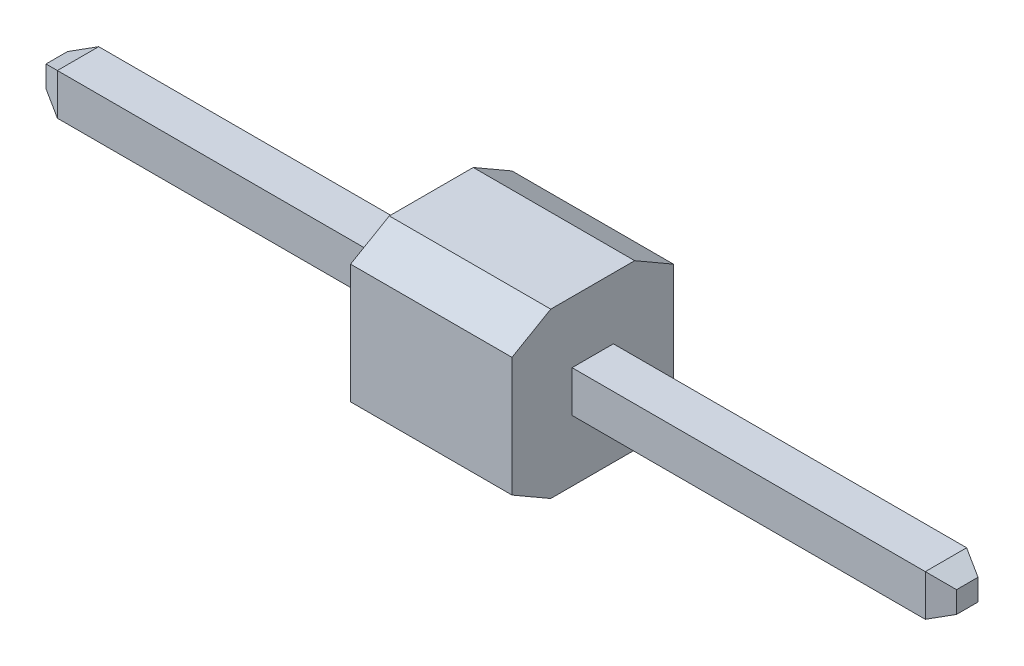
ISO-10303-21;
HEADER;
FILE_DESCRIPTION(('STEP AP214'),'2;1');
FILE_NAME('part.step','',(''),(''),'','','');
FILE_SCHEMA(('AUTOMOTIVE_DESIGN { 1 0 10303 214 1 1 1 1 }'));
ENDSEC;
DATA;
#1=APPLICATION_CONTEXT('core data for automotive mechanical design processes');
#2=APPLICATION_PROTOCOL_DEFINITION('international standard','automotive_design',2000,#1);
#3=PRODUCT_CONTEXT('',#1,'mechanical');
#4=PRODUCT('Part','Part','',(#3));
#5=PRODUCT_RELATED_PRODUCT_CATEGORY('part','',(#4));
#6=PRODUCT_DEFINITION_FORMATION('','',#4);
#7=PRODUCT_DEFINITION_CONTEXT('part definition',#1,'design');
#8=PRODUCT_DEFINITION('design','',#6,#7);
#9=PRODUCT_DEFINITION_SHAPE('','',#8);
#10=(LENGTH_UNIT() NAMED_UNIT(*) SI_UNIT(.MILLI.,.METRE.));
#11=(NAMED_UNIT(*) PLANE_ANGLE_UNIT() SI_UNIT($,.RADIAN.));
#12=(NAMED_UNIT(*) SI_UNIT($,.STERADIAN.) SOLID_ANGLE_UNIT());
#13=UNCERTAINTY_MEASURE_WITH_UNIT(LENGTH_MEASURE(1.E-05),#10,'distance_accuracy_value','');
#14=(GEOMETRIC_REPRESENTATION_CONTEXT(3) GLOBAL_UNCERTAINTY_ASSIGNED_CONTEXT((#13)) GLOBAL_UNIT_ASSIGNED_CONTEXT((#10,
#11,#12)) REPRESENTATION_CONTEXT('',''));
#15=CARTESIAN_POINT('',(0.,0.,0.));
#16=DIRECTION('',(0.,0.,1.));
#17=DIRECTION('',(1.,0.,0.));
#18=AXIS2_PLACEMENT_3D('',#15,#16,#17);
#19=CARTESIAN_POINT('',(5.42105161362358,7.93712144810304,-2.62999892057032));
#20=DIRECTION('',(1.,-9.93476518829084E-08,4.37113882867379E-08));
#21=DIRECTION('',(-9.93476589883358E-08,-1.,8.74227765734759E-08));
#22=AXIS2_PLACEMENT_3D('',#19,#20,#21);
#23=PLANE('',#22);
#24=DIRECTION('',(-1.18186632779335E-08,-0.50000007571054,-0.866025360072934));
#25=VECTOR('',#24,1.);
#26=CARTESIAN_POINT('',(5.42105142144897,6.69353174686681,-1.05999881185224));
#27=LINE('',#26,#25);
#28=CARTESIAN_POINT('',(5.42105142144897,6.69353174686681,-1.05999881185224));
#29=VERTEX_POINT('',#28);
#30=CARTESIAN_POINT('',(5.42105141326076,6.34712153290314,-1.6599987815681));
#31=VERTEX_POINT('',#30);
#32=EDGE_CURVE('E11',#29,#31,#27,.T.);
#33=ORIENTED_EDGE('',*,*,#32,.T.);
#34=DIRECTION('',(4.37113811813104E-08,-8.74227842254741E-08,-0.999999999999995));
#35=VECTOR('',#34,1.);
#36=CARTESIAN_POINT('',(5.42105141326076,6.34712153290314,-1.6599987815681));
#37=LINE('',#36,#35);
#38=CARTESIAN_POINT('',(5.42105147008556,6.34712141925352,-2.9599987815681));
#39=VERTEX_POINT('',#38);
#40=EDGE_CURVE('E304',#31,#39,#37,.T.);
#41=ORIENTED_EDGE('',*,*,#40,.T.);
#42=DIRECTION('',(8.75289963531793E-08,0.499999924289839,-0.866025447495712));
#43=VECTOR('',#42,1.);
#44=CARTESIAN_POINT('',(5.42105147008556,6.34712141925352,-2.9599987815681));
#45=LINE('',#44,#43);
#46=CARTESIAN_POINT('',(5.42105153072743,6.69353152830985,-3.55999881185224));
#47=VERTEX_POINT('',#46);
#48=EDGE_CURVE('E296',#39,#47,#45,.T.);
#49=ORIENTED_EDGE('',*,*,#48,.T.);
#50=DIRECTION('',(9.93476588436476E-08,0.999999999999991,-8.74227764822786E-08));
#51=VECTOR('',#50,1.);
#52=CARTESIAN_POINT('',(5.42105153072743,6.69353152830985,-3.55999881185224));
#53=LINE('',#52,#51);
#54=CARTESIAN_POINT('',(5.4210517142404,8.54071120527985,-3.55999897333782));
#55=VERTEX_POINT('',#54);
#56=EDGE_CURVE('E281',#47,#55,#53,.T.);
#57=ORIENTED_EDGE('',*,*,#56,.T.);
#58=DIRECTION('',(-1.18186632778483E-08,-0.500000075710534,-0.866025360072937));
#59=VECTOR('',#58,1.);
#60=CARTESIAN_POINT('',(5.42105172242861,8.88712141925352,-2.95999900362196));
#61=LINE('',#60,#59);
#62=CARTESIAN_POINT('',(5.42105172242861,8.88712141925352,-2.95999900362196));
#63=VERTEX_POINT('',#62);
#64=EDGE_CURVE('E265',#63,#55,#61,.T.);
#65=ORIENTED_EDGE('',*,*,#64,.F.);
#66=DIRECTION('',(4.37113811813104E-08,-8.74227842254741E-08,-0.999999999999995));
#67=VECTOR('',#66,1.);
#68=CARTESIAN_POINT('',(5.42105166560382,8.88712153290314,-1.65999900362196));
#69=LINE('',#68,#67);
#70=CARTESIAN_POINT('',(5.42105166560382,8.88712153290314,-1.65999900362196));
#71=VERTEX_POINT('',#70);
#72=EDGE_CURVE('E248',#71,#63,#69,.T.);
#73=ORIENTED_EDGE('',*,*,#72,.F.);
#74=DIRECTION('',(8.75289963525481E-08,0.499999924289833,-0.866025447495715));
#75=VECTOR('',#74,1.);
#76=CARTESIAN_POINT('',(5.42105160496195,8.54071142383681,-1.05999897333782));
#77=LINE('',#76,#75);
#78=CARTESIAN_POINT('',(5.42105160496195,8.54071142383681,-1.05999897333782));
#79=VERTEX_POINT('',#78);
#80=EDGE_CURVE('E242',#79,#71,#77,.T.);
#81=ORIENTED_EDGE('',*,*,#80,.F.);
#82=DIRECTION('',(9.93476588436476E-08,0.999999999999991,-8.74227762418639E-08));
#83=VECTOR('',#82,1.);
#84=CARTESIAN_POINT('',(5.42105142144897,6.69353174686681,-1.05999881185224));
#85=LINE('',#84,#83);
#86=EDGE_CURVE('E236',#29,#79,#85,.T.);
#87=ORIENTED_EDGE('',*,*,#86,.F.);
#88=EDGE_LOOP('',(#33,#41,#49,#57,#65,#73,#81,#87));
#89=FACE_BOUND('',#88,.T.);
#90=DIRECTION('',(-4.37113817364219E-08,8.74227856773042E-08,0.999999999999995));
#91=VECTOR('',#90,1.);
#92=CARTESIAN_POINT('',(5.42105155004108,7.29712144810304,-2.62999886461974));
#93=LINE('',#92,#91);
#94=CARTESIAN_POINT('',(5.42105155004108,7.29712144810304,-2.62999886461974));
#95=VERTEX_POINT('',#94);
#96=CARTESIAN_POINT('',(5.4210515220658,7.29712150405362,-1.98999886461974));
#97=VERTEX_POINT('',#96);
#98=EDGE_CURVE('E302',#95,#97,#93,.T.);
#99=ORIENTED_EDGE('',*,*,#98,.T.);
#100=DIRECTION('',(-9.93476592658906E-08,-0.999999999999991,8.74227766567418E-08));
#101=VECTOR('',#100,1.);
#102=CARTESIAN_POINT('',(5.4210515856483,7.93712150405362,-1.98999892057032));
#103=LINE('',#102,#101);
#104=CARTESIAN_POINT('',(5.4210515856483,7.93712150405362,-1.98999892057032));
#105=VERTEX_POINT('',#104);
#106=EDGE_CURVE('E293',#105,#97,#103,.T.);
#107=ORIENTED_EDGE('',*,*,#106,.F.);
#108=DIRECTION('',(-4.37113803486431E-08,8.74227856773043E-08,0.999999999999995));
#109=VECTOR('',#108,1.);
#110=CARTESIAN_POINT('',(5.42105161362358,7.93712144810304,-2.62999892057032));
#111=LINE('',#110,#109);
#112=CARTESIAN_POINT('',(5.42105161362358,7.93712144810304,-2.62999892057032));
#113=VERTEX_POINT('',#112);
#114=EDGE_CURVE('E278',#113,#105,#111,.T.);
#115=ORIENTED_EDGE('',*,*,#114,.F.);
#116=DIRECTION('',(-9.93476578781118E-08,-0.999999999999991,8.74227759628524E-08));
#117=VECTOR('',#116,1.);
#118=CARTESIAN_POINT('',(5.42105161362358,7.93712144810304,-2.62999892057032));
#119=LINE('',#118,#117);
#120=EDGE_CURVE('E263',#113,#95,#119,.T.);
#121=ORIENTED_EDGE('',*,*,#120,.T.);
#122=EDGE_LOOP('',(#99,#107,#115,#121));
#123=FACE_BOUND('',#122,.T.);
#124=ADVANCED_FACE('F17',(#89,#123),#23,.T.);
#125=CARTESIAN_POINT('',(2.92105161362358,7.93712169647217,-2.62999902984879));
#126=DIRECTION('',(1.,-9.93476518829084E-08,4.37113882867379E-08));
#127=DIRECTION('',(-9.93476589883358E-08,-1.,8.74227765734759E-08));
#128=AXIS2_PLACEMENT_3D('',#125,#126,#127);
#129=PLANE('',#128);
#130=DIRECTION('',(-1.1818662636946E-08,-0.50000007571054,-0.866025360072934));
#131=VECTOR('',#130,1.);
#132=CARTESIAN_POINT('',(2.92105142144897,6.69353199523594,-1.05999892113071));
#133=LINE('',#132,#131);
#134=CARTESIAN_POINT('',(2.92105142144897,6.69353199523594,-1.05999892113071));
#135=VERTEX_POINT('',#134);
#136=CARTESIAN_POINT('',(2.92105141326076,6.34712178127227,-1.65999889084657));
#137=VERTEX_POINT('',#136);
#138=EDGE_CURVE('E24',#135,#137,#133,.T.);
#139=ORIENTED_EDGE('',*,*,#138,.F.);
#140=DIRECTION('',(9.93476590840623E-08,0.999999999999991,-8.74227762418639E-08));
#141=VECTOR('',#140,1.);
#142=CARTESIAN_POINT('',(2.92105142144897,6.69353199523594,-1.05999892113071));
#143=LINE('',#142,#141);
#144=CARTESIAN_POINT('',(2.92105160496195,8.54071167220594,-1.05999908261629));
#145=VERTEX_POINT('',#144);
#146=EDGE_CURVE('E300',#135,#145,#143,.T.);
#147=ORIENTED_EDGE('',*,*,#146,.T.);
#148=DIRECTION('',(8.75289957115606E-08,0.499999924289833,-0.866025447495715));
#149=VECTOR('',#148,1.);
#150=CARTESIAN_POINT('',(2.92105160496195,8.54071167220594,-1.05999908261629));
#151=LINE('',#150,#149);
#152=CARTESIAN_POINT('',(2.92105166560382,8.88712178127227,-1.65999911290043));
#153=VERTEX_POINT('',#152);
#154=EDGE_CURVE('E286',#145,#153,#151,.T.);
#155=ORIENTED_EDGE('',*,*,#154,.T.);
#156=DIRECTION('',(4.37113811813104E-08,-8.74227842254741E-08,-0.999999999999995));
#157=VECTOR('',#156,1.);
#158=CARTESIAN_POINT('',(2.92105166560382,8.88712178127227,-1.65999911290043));
#159=LINE('',#158,#157);
#160=CARTESIAN_POINT('',(2.92105172242861,8.88712166762265,-2.95999911290043));
#161=VERTEX_POINT('',#160);
#162=EDGE_CURVE('E271',#153,#161,#159,.T.);
#163=ORIENTED_EDGE('',*,*,#162,.T.);
#164=DIRECTION('',(-1.18186626368607E-08,-0.500000075710534,-0.866025360072937));
#165=VECTOR('',#164,1.);
#166=CARTESIAN_POINT('',(2.92105172242861,8.88712166762265,-2.95999911290043));
#167=LINE('',#166,#165);
#168=CARTESIAN_POINT('',(2.9210517142404,8.54071145364898,-3.55999908261629));
#169=VERTEX_POINT('',#168);
#170=EDGE_CURVE('E253',#161,#169,#167,.T.);
#171=ORIENTED_EDGE('',*,*,#170,.T.);
#172=DIRECTION('',(9.93476590840623E-08,0.999999999999991,-8.74227764822786E-08));
#173=VECTOR('',#172,1.);
#174=CARTESIAN_POINT('',(2.92105153072743,6.69353177667898,-3.55999892113071));
#175=LINE('',#174,#173);
#176=CARTESIAN_POINT('',(2.92105153072743,6.69353177667898,-3.55999892113071));
#177=VERTEX_POINT('',#176);
#178=EDGE_CURVE('E261',#177,#169,#175,.T.);
#179=ORIENTED_EDGE('',*,*,#178,.F.);
#180=DIRECTION('',(8.75289957121918E-08,0.499999924289839,-0.866025447495712));
#181=VECTOR('',#180,1.);
#182=CARTESIAN_POINT('',(2.92105147008556,6.34712166762265,-2.95999889084657));
#183=LINE('',#182,#181);
#184=CARTESIAN_POINT('',(2.92105147008556,6.34712166762265,-2.95999889084657));
#185=VERTEX_POINT('',#184);
#186=EDGE_CURVE('E276',#185,#177,#183,.T.);
#187=ORIENTED_EDGE('',*,*,#186,.F.);
#188=DIRECTION('',(4.37113811813104E-08,-8.74227842254741E-08,-0.999999999999995));
#189=VECTOR('',#188,1.);
#190=CARTESIAN_POINT('',(2.92105141326076,6.34712178127227,-1.65999889084657));
#191=LINE('',#190,#189);
#192=EDGE_CURVE('E291',#137,#185,#191,.T.);
#193=ORIENTED_EDGE('',*,*,#192,.F.);
#194=EDGE_LOOP('',(#139,#147,#155,#163,#171,#179,#187,#193));
#195=FACE_BOUND('',#194,.T.);
#196=DIRECTION('',(-9.93476592658906E-08,-0.999999999999991,8.74227766567418E-08));
#197=VECTOR('',#196,1.);
#198=CARTESIAN_POINT('',(2.9210515856483,7.93712175242275,-1.98999902984879));
#199=LINE('',#198,#197);
#200=CARTESIAN_POINT('',(2.9210515856483,7.93712175242275,-1.98999902984879));
#201=VERTEX_POINT('',#200);
#202=CARTESIAN_POINT('',(2.9210515220658,7.29712175242275,-1.98999897389821));
#203=VERTEX_POINT('',#202);
#204=EDGE_CURVE('E298',#201,#203,#199,.T.);
#205=ORIENTED_EDGE('',*,*,#204,.T.);
#206=DIRECTION('',(-4.37113810425325E-08,8.74227856773042E-08,0.999999999999995));
#207=VECTOR('',#206,1.);
#208=CARTESIAN_POINT('',(2.92105155004108,7.29712169647217,-2.62999897389821));
#209=LINE('',#208,#207);
#210=CARTESIAN_POINT('',(2.92105155004108,7.29712169647217,-2.62999897389821));
#211=VERTEX_POINT('',#210);
#212=EDGE_CURVE('E283',#211,#203,#209,.T.);
#213=ORIENTED_EDGE('',*,*,#212,.F.);
#214=DIRECTION('',(-9.93476592658906E-08,-0.999999999999991,8.74227759628524E-08));
#215=VECTOR('',#214,1.);
#216=CARTESIAN_POINT('',(2.92105161362358,7.93712169647217,-2.62999902984879));
#217=LINE('',#216,#215);
#218=CARTESIAN_POINT('',(2.92105161362358,7.93712169647217,-2.62999902984879));
#219=VERTEX_POINT('',#218);
#220=EDGE_CURVE('E268',#219,#211,#217,.T.);
#221=ORIENTED_EDGE('',*,*,#220,.F.);
#222=DIRECTION('',(-4.37113810425325E-08,8.74227856773043E-08,0.999999999999995));
#223=VECTOR('',#222,1.);
#224=CARTESIAN_POINT('',(2.92105161362358,7.93712169647217,-2.62999902984879));
#225=LINE('',#224,#223);
#226=EDGE_CURVE('E251',#219,#201,#225,.T.);
#227=ORIENTED_EDGE('',*,*,#226,.T.);
#228=EDGE_LOOP('',(#205,#213,#221,#227));
#229=FACE_BOUND('',#228,.T.);
#230=ADVANCED_FACE('F314',(#195,#229),#129,.F.);
#231=CARTESIAN_POINT('',(5.42105142144897,6.69353174686681,-1.05999881185224));
#232=DIRECTION('',(1.07893287081065E-07,0.866025360072937,-0.500000075710535));
#233=DIRECTION('',(1.18186629566715E-08,0.500000075710542,0.866025360072941));
#234=AXIS2_PLACEMENT_3D('',#231,#232,#233);
#235=PLANE('',#234);
#236=ORIENTED_EDGE('',*,*,#138,.T.);
#237=DIRECTION('',(-0.999999999999994,9.93476533039933E-08,-4.37113882867377E-08));
#238=VECTOR('',#237,1.);
#239=CARTESIAN_POINT('',(5.42105141326076,6.34712153290314,-1.6599987815681));
#240=LINE('',#239,#238);
#241=EDGE_CURVE('E288',#31,#137,#240,.T.);
#242=ORIENTED_EDGE('',*,*,#241,.F.);
#243=ORIENTED_EDGE('',*,*,#32,.F.);
#244=DIRECTION('',(-0.999999999999994,9.93476504618223E-08,-4.3711388109102E-08));
#245=VECTOR('',#244,1.);
#246=CARTESIAN_POINT('',(5.42105142144897,6.69353174686681,-1.05999881185224));
#247=LINE('',#246,#245);
#248=EDGE_CURVE('E256',#29,#135,#247,.T.);
#249=ORIENTED_EDGE('',*,*,#248,.T.);
#250=EDGE_LOOP('',(#236,#242,#243,#249));
#251=FACE_BOUND('',#250,.T.);
#252=ADVANCED_FACE('F306',(#251),#235,.F.);
#253=CARTESIAN_POINT('',(5.42105141326076,6.34712153290314,-1.6599987815681));
#254=DIRECTION('',(9.93476589883358E-08,1.,-8.74227765734759E-08));
#255=DIRECTION('',(1.,-9.93476518829084E-08,4.37113882867379E-08));
#256=AXIS2_PLACEMENT_3D('',#253,#254,#255);
#257=PLANE('',#256);
#258=ORIENTED_EDGE('',*,*,#192,.T.);
#259=DIRECTION('',(-0.999999999999994,9.93476533039933E-08,-4.37113882867377E-08));
#260=VECTOR('',#259,1.);
#261=CARTESIAN_POINT('',(5.42105147008556,6.34712141925352,-2.9599987815681));
#262=LINE('',#261,#260);
#263=EDGE_CURVE('E273',#39,#185,#262,.T.);
#264=ORIENTED_EDGE('',*,*,#263,.F.);
#265=ORIENTED_EDGE('',*,*,#40,.F.);
#266=ORIENTED_EDGE('',*,*,#241,.T.);
#267=EDGE_LOOP('',(#258,#264,#265,#266));
#268=FACE_BOUND('',#267,.T.);
#269=ADVANCED_FACE('F311',(#268),#257,.F.);
#270=CARTESIAN_POINT('',(5.42105147008556,6.34712141925352,-2.9599987815681));
#271=DIRECTION('',(6.41819058997377E-08,0.866025447495721,0.499999924289845));
#272=DIRECTION('',(-8.7528996031702E-08,-0.499999924289838,0.866025447495717));
#273=AXIS2_PLACEMENT_3D('',#270,#271,#272);
#274=PLANE('',#273);
#275=ORIENTED_EDGE('',*,*,#186,.T.);
#276=DIRECTION('',(-0.999999999999994,9.93476504618223E-08,-4.37113882867377E-08));
#277=VECTOR('',#276,1.);
#278=CARTESIAN_POINT('',(5.42105153072743,6.69353152830985,-3.55999881185224));
#279=LINE('',#278,#277);
#280=EDGE_CURVE('E258',#47,#177,#279,.T.);
#281=ORIENTED_EDGE('',*,*,#280,.F.);
#282=ORIENTED_EDGE('',*,*,#48,.F.);
#283=ORIENTED_EDGE('',*,*,#263,.T.);
#284=EDGE_LOOP('',(#275,#281,#282,#283));
#285=FACE_BOUND('',#284,.T.);
#286=ADVANCED_FACE('F319',(#285),#274,.F.);
#287=CARTESIAN_POINT('',(5.42105153072743,6.69353152830985,-3.55999881185224));
#288=DIRECTION('',(-4.37113811813106E-08,8.74227836789032E-08,1.));
#289=DIRECTION('',(-1.,9.93476518829084E-08,-4.37113882867379E-08));
#290=AXIS2_PLACEMENT_3D('',#287,#288,#289);
#291=PLANE('',#290);
#292=ORIENTED_EDGE('',*,*,#178,.T.);
#293=DIRECTION('',(-0.999999999999994,9.93476504618223E-08,-4.37113882867377E-08));
#294=VECTOR('',#293,1.);
#295=CARTESIAN_POINT('',(5.4210517142404,8.54071120527985,-3.55999897333782));
#296=LINE('',#295,#294);
#297=EDGE_CURVE('E245',#55,#169,#296,.T.);
#298=ORIENTED_EDGE('',*,*,#297,.F.);
#299=ORIENTED_EDGE('',*,*,#56,.F.);
#300=ORIENTED_EDGE('',*,*,#280,.T.);
#301=EDGE_LOOP('',(#292,#298,#299,#300));
#302=FACE_BOUND('',#301,.T.);
#303=ADVANCED_FACE('F326',(#302),#291,.F.);
#304=CARTESIAN_POINT('',(5.42105172242861,8.88712141925352,-2.95999900362196));
#305=DIRECTION('',(1.07893287081065E-07,0.866025360072937,-0.500000075710535));
#306=DIRECTION('',(1.18186629566715E-08,0.500000075710542,0.866025360072941));
#307=AXIS2_PLACEMENT_3D('',#304,#305,#306);
#308=PLANE('',#307);
#309=ORIENTED_EDGE('',*,*,#170,.F.);
#310=DIRECTION('',(-0.999999999999994,9.93476504618223E-08,-4.37113882867377E-08));
#311=VECTOR('',#310,1.);
#312=CARTESIAN_POINT('',(5.42105172242861,8.88712141925352,-2.95999900362196));
#313=LINE('',#312,#311);
#314=EDGE_CURVE('E239',#63,#161,#313,.T.);
#315=ORIENTED_EDGE('',*,*,#314,.F.);
#316=ORIENTED_EDGE('',*,*,#64,.T.);
#317=ORIENTED_EDGE('',*,*,#297,.T.);
#318=EDGE_LOOP('',(#309,#315,#316,#317));
#319=FACE_BOUND('',#318,.T.);
#320=ADVANCED_FACE('F329',(#319),#308,.T.);
#321=CARTESIAN_POINT('',(5.42105166560382,8.88712153290314,-1.65999900362196));
#322=DIRECTION('',(9.93476589883358E-08,1.,-8.74227765734759E-08));
#323=DIRECTION('',(1.,-9.93476518829084E-08,4.37113882867379E-08));
#324=AXIS2_PLACEMENT_3D('',#321,#322,#323);
#325=PLANE('',#324);
#326=ORIENTED_EDGE('',*,*,#162,.F.);
#327=DIRECTION('',(-0.999999999999994,9.93476504618223E-08,-4.37113884643734E-08));
#328=VECTOR('',#327,1.);
#329=CARTESIAN_POINT('',(5.42105166560382,8.88712153290314,-1.65999900362196));
#330=LINE('',#329,#328);
#331=EDGE_CURVE('E233',#71,#153,#330,.T.);
#332=ORIENTED_EDGE('',*,*,#331,.F.);
#333=ORIENTED_EDGE('',*,*,#72,.T.);
#334=ORIENTED_EDGE('',*,*,#314,.T.);
#335=EDGE_LOOP('',(#326,#332,#333,#334));
#336=FACE_BOUND('',#335,.T.);
#337=ADVANCED_FACE('F333',(#336),#325,.T.);
#338=CARTESIAN_POINT('',(5.42105160496195,8.54071142383681,-1.05999897333782));
#339=DIRECTION('',(6.41819058997377E-08,0.866025447495721,0.499999924289845));
#340=DIRECTION('',(-8.7528996031702E-08,-0.499999924289838,0.866025447495717));
#341=AXIS2_PLACEMENT_3D('',#338,#339,#340);
#342=PLANE('',#341);
#343=ORIENTED_EDGE('',*,*,#154,.F.);
#344=DIRECTION('',(-0.999999999999994,9.93476504618223E-08,-4.3711388109102E-08));
#345=VECTOR('',#344,1.);
#346=CARTESIAN_POINT('',(5.42105160496195,8.54071142383681,-1.05999897333782));
#347=LINE('',#346,#345);
#348=EDGE_CURVE('E230',#79,#145,#347,.T.);
#349=ORIENTED_EDGE('',*,*,#348,.F.);
#350=ORIENTED_EDGE('',*,*,#80,.T.);
#351=ORIENTED_EDGE('',*,*,#331,.T.);
#352=EDGE_LOOP('',(#343,#349,#350,#351));
#353=FACE_BOUND('',#352,.T.);
#354=ADVANCED_FACE('F337',(#353),#342,.T.);
#355=CARTESIAN_POINT('',(5.42105142144897,6.69353174686681,-1.05999881185224));
#356=DIRECTION('',(-4.37113811813106E-08,8.74227835615132E-08,1.));
#357=DIRECTION('',(-9.93476589883358E-08,-1.,8.74227764560859E-08));
#358=AXIS2_PLACEMENT_3D('',#355,#356,#357);
#359=PLANE('',#358);
#360=ORIENTED_EDGE('',*,*,#146,.F.);
#361=ORIENTED_EDGE('',*,*,#248,.F.);
#362=ORIENTED_EDGE('',*,*,#86,.T.);
#363=ORIENTED_EDGE('',*,*,#348,.T.);
#364=EDGE_LOOP('',(#360,#361,#362,#363));
#365=FACE_BOUND('',#364,.T.);
#366=ADVANCED_FACE('F339',(#365),#359,.T.);
#367=CARTESIAN_POINT('',(-2.87894838637642,7.93712227268855,-2.62999928337484));
#368=DIRECTION('',(-1.,9.93476518829084E-08,-4.37113882867379E-08));
#369=DIRECTION('',(9.93476589883358E-08,1.,-8.74227765734759E-08));
#370=AXIS2_PLACEMENT_3D('',#367,#368,#369);
#371=PLANE('',#370);
#372=DIRECTION('',(9.93476634944484E-08,0.999999999999991,-8.7422776141512E-08));
#373=VECTOR('',#372,1.);
#374=CARTESIAN_POINT('',(-2.87894845592006,7.45100384237638,-2.14388076806801));
#375=LINE('',#374,#373);
#376=CARTESIAN_POINT('',(-2.87894845592006,7.45100384237638,-2.14388076806801));
#377=VERTEX_POINT('',#376);
#378=CARTESIAN_POINT('',(-2.8789484229131,7.78324078798638,-2.14388079711309));
#379=VERTEX_POINT('',#378);
#380=EDGE_CURVE('E228',#377,#379,#375,.T.);
#381=ORIENTED_EDGE('',*,*,#380,.T.);
#382=DIRECTION('',(4.37113793813867E-08,-8.74227854960561E-08,-0.999999999999995));
#383=VECTOR('',#382,1.);
#384=CARTESIAN_POINT('',(-2.8789484229131,7.78324078798638,-2.14388079711309));
#385=LINE('',#384,#383);
#386=CARTESIAN_POINT('',(-2.87894840839056,7.7832407589413,-2.47611774273109));
#387=VERTEX_POINT('',#386);
#388=EDGE_CURVE('E223',#379,#387,#385,.T.);
#389=ORIENTED_EDGE('',*,*,#388,.T.);
#390=DIRECTION('',(-9.93476608211201E-08,-0.999999999999991,8.7422776141512E-08));
#391=VECTOR('',#390,1.);
#392=CARTESIAN_POINT('',(-2.87894840839056,7.7832407589413,-2.47611774273109));
#393=LINE('',#392,#391);
#394=CARTESIAN_POINT('',(-2.87894844139752,7.4510038133313,-2.47611771368601));
#395=VERTEX_POINT('',#394);
#396=EDGE_CURVE('E215',#387,#395,#393,.T.);
#397=ORIENTED_EDGE('',*,*,#396,.T.);
#398=DIRECTION('',(-4.37113767080584E-08,8.7422774802743E-08,0.999999999999995));
#399=VECTOR('',#398,1.);
#400=CARTESIAN_POINT('',(-2.87894844139753,7.4510038133313,-2.47611771368601));
#401=LINE('',#400,#399);
#402=EDGE_CURVE('E207',#395,#377,#401,.T.);
#403=ORIENTED_EDGE('',*,*,#402,.T.);
#404=EDGE_LOOP('',(#381,#389,#397,#403));
#405=FACE_BOUND('',#404,.T.);
#406=ADVANCED_FACE('F341',(#405),#371,.T.);
#407=CARTESIAN_POINT('',(-2.87894838637642,7.93712227268855,-2.62999928337484));
#408=DIRECTION('',(9.93476589883358E-08,1.,-8.74227764510112E-08));
#409=DIRECTION('',(-4.37113811813106E-08,8.74227835564385E-08,1.));
#410=AXIS2_PLACEMENT_3D('',#407,#408,#409);
#411=PLANE('',#410);
#412=DIRECTION('',(0.999999999999994,-9.93476534027159E-08,4.37113883581816E-08));
#413=VECTOR('',#412,1.);
#414=CARTESIAN_POINT('',(-2.54894838637642,7.93712223990383,-2.62999926895008));
#415=LINE('',#414,#413);
#416=CARTESIAN_POINT('',(-2.54894838637642,7.93712223990383,-2.62999926895008));
#417=VERTEX_POINT('',#416);
#418=EDGE_CURVE('E225',#417,#219,#415,.T.);
#419=ORIENTED_EDGE('',*,*,#418,.F.);
#420=DIRECTION('',(-4.37113803486431E-08,8.74227856773042E-08,0.999999999999995));
#421=VECTOR('',#420,1.);
#422=CARTESIAN_POINT('',(-2.54894838637642,7.93712223990383,-2.62999926895008));
#423=LINE('',#422,#421);
#424=CARTESIAN_POINT('',(-2.5489484143517,7.93712229585441,-1.98999926895008));
#425=VERTEX_POINT('',#424);
#426=EDGE_CURVE('E217',#417,#425,#423,.T.);
#427=ORIENTED_EDGE('',*,*,#426,.T.);
#428=DIRECTION('',(0.999999999999994,-9.93476534027159E-08,4.37113882364022E-08));
#429=VECTOR('',#428,1.);
#430=CARTESIAN_POINT('',(-2.5489484143517,7.93712229585441,-1.98999926895008));
#431=LINE('',#430,#429);
#432=EDGE_CURVE('E220',#425,#201,#431,.T.);
#433=ORIENTED_EDGE('',*,*,#432,.T.);
#434=ORIENTED_EDGE('',*,*,#226,.F.);
#435=EDGE_LOOP('',(#419,#427,#433,#434));
#436=FACE_BOUND('',#435,.T.);
#437=ADVANCED_FACE('F348',(#436),#411,.T.);
#438=CARTESIAN_POINT('',(-2.8789484143517,7.93712232863913,-1.98999928337484));
#439=DIRECTION('',(-4.37113811813106E-08,8.74227836789032E-08,1.));
#440=DIRECTION('',(-1.,9.93476518829084E-08,-4.37113882867379E-08));
#441=AXIS2_PLACEMENT_3D('',#438,#439,#440);
#442=PLANE('',#441);
#443=ORIENTED_EDGE('',*,*,#432,.F.);
#444=DIRECTION('',(-9.93476592658906E-08,-0.999999999999991,8.74227766567418E-08));
#445=VECTOR('',#444,1.);
#446=CARTESIAN_POINT('',(-2.5489484143517,7.93712229585441,-1.98999926895008));
#447=LINE('',#446,#445);
#448=CARTESIAN_POINT('',(-2.5489484779342,7.29712229585441,-1.98999921299951));
#449=VERTEX_POINT('',#448);
#450=EDGE_CURVE('E209',#425,#449,#447,.T.);
#451=ORIENTED_EDGE('',*,*,#450,.T.);
#452=DIRECTION('',(0.999999999999994,-9.93476534027159E-08,4.37113882364022E-08));
#453=VECTOR('',#452,1.);
#454=CARTESIAN_POINT('',(-2.5489484779342,7.29712229585441,-1.98999921299951));
#455=LINE('',#454,#453);
#456=EDGE_CURVE('E212',#449,#203,#455,.T.);
#457=ORIENTED_EDGE('',*,*,#456,.T.);
#458=ORIENTED_EDGE('',*,*,#204,.F.);
#459=EDGE_LOOP('',(#443,#451,#457,#458));
#460=FACE_BOUND('',#459,.T.);
#461=ADVANCED_FACE('F424',(#460),#442,.T.);
#462=CARTESIAN_POINT('',(-2.87894844995892,7.29712227268855,-2.62999922742426));
#463=DIRECTION('',(9.93476589883357E-08,1.,-8.74227764040693E-08));
#464=DIRECTION('',(-4.37113811813106E-08,8.74227835094966E-08,1.));
#465=AXIS2_PLACEMENT_3D('',#462,#463,#464);
#466=PLANE('',#465);
#467=ORIENTED_EDGE('',*,*,#456,.F.);
#468=DIRECTION('',(4.37113831242006E-08,-8.74227967795345E-08,-0.999999999999995));
#469=VECTOR('',#468,1.);
#470=CARTESIAN_POINT('',(-2.54894847793421,7.29712229585441,-1.98999921299951));
#471=LINE('',#470,#469);
#472=CARTESIAN_POINT('',(-2.54894844995892,7.29712223990382,-2.62999921299951));
#473=VERTEX_POINT('',#472);
#474=EDGE_CURVE('E201',#449,#473,#471,.T.);
#475=ORIENTED_EDGE('',*,*,#474,.T.);
#476=DIRECTION('',(0.999999999999994,-9.93476534027159E-08,4.37113882769953E-08));
#477=VECTOR('',#476,1.);
#478=CARTESIAN_POINT('',(-2.54894844995892,7.29712223990382,-2.62999921299951));
#479=LINE('',#478,#477);
#480=EDGE_CURVE('E204',#473,#211,#479,.T.);
#481=ORIENTED_EDGE('',*,*,#480,.T.);
#482=ORIENTED_EDGE('',*,*,#212,.T.);
#483=EDGE_LOOP('',(#467,#475,#481,#482));
#484=FACE_BOUND('',#483,.T.);
#485=ADVANCED_FACE('F421',(#484),#466,.F.);
#486=CARTESIAN_POINT('',(-2.87894838637642,7.93712227268855,-2.62999928337484));
#487=DIRECTION('',(-4.37113811813106E-08,8.74227836789032E-08,1.));
#488=DIRECTION('',(-1.,9.93476518829084E-08,-4.37113882867379E-08));
#489=AXIS2_PLACEMENT_3D('',#486,#487,#488);
#490=PLANE('',#489);
#491=ORIENTED_EDGE('',*,*,#480,.F.);
#492=DIRECTION('',(9.9347656490333E-08,0.999999999999991,-8.74227766567418E-08));
#493=VECTOR('',#492,1.);
#494=CARTESIAN_POINT('',(-2.54894844995892,7.29712223990382,-2.62999921299951));
#495=LINE('',#494,#493);
#496=EDGE_CURVE('E196',#473,#417,#495,.T.);
#497=ORIENTED_EDGE('',*,*,#496,.T.);
#498=ORIENTED_EDGE('',*,*,#418,.T.);
#499=ORIENTED_EDGE('',*,*,#220,.T.);
#500=EDGE_LOOP('',(#491,#497,#498,#499));
#501=FACE_BOUND('',#500,.T.);
#502=ADVANCED_FACE('F376',(#501),#490,.F.);
#503=CARTESIAN_POINT('',(-2.87894838637642,7.93712227268855,-2.62999928337484));
#504=DIRECTION('',(-4.37113811813106E-08,8.74227836789032E-08,1.));
#505=DIRECTION('',(-1.,9.93476518829084E-08,-4.37113882867379E-08));
#506=AXIS2_PLACEMENT_3D('',#503,#504,#505);
#507=PLANE('',#506);
#508=DIRECTION('',(0.999999999999994,-9.93476521037346E-08,4.37113882769953E-08));
#509=VECTOR('',#508,1.);
#510=CARTESIAN_POINT('',(5.42105161362358,7.93712144810303,-2.62999892057032));
#511=LINE('',#510,#509);
#512=CARTESIAN_POINT('',(10.8910516136236,7.93712090467138,-2.62999868146902));
#513=VERTEX_POINT('',#512);
#514=EDGE_CURVE('E199',#113,#513,#511,.T.);
#515=ORIENTED_EDGE('',*,*,#514,.T.);
#516=DIRECTION('',(-9.93476606536693E-08,-0.999999999999991,8.74227766567418E-08));
#517=VECTOR('',#516,1.);
#518=CARTESIAN_POINT('',(10.8910516136236,7.93712090467138,-2.62999868146902));
#519=LINE('',#518,#517);
#520=CARTESIAN_POINT('',(10.8910515500411,7.29712090467138,-2.62999862551845));
#521=VERTEX_POINT('',#520);
#522=EDGE_CURVE('E191',#513,#521,#519,.T.);
#523=ORIENTED_EDGE('',*,*,#522,.T.);
#524=DIRECTION('',(0.999999999999994,-9.93476469078097E-08,4.37113883581817E-08));
#525=VECTOR('',#524,1.);
#526=CARTESIAN_POINT('',(5.42105155004108,7.29712144810305,-2.62999886461974));
#527=LINE('',#526,#525);
#528=EDGE_CURVE('E194',#95,#521,#527,.T.);
#529=ORIENTED_EDGE('',*,*,#528,.F.);
#530=ORIENTED_EDGE('',*,*,#120,.F.);
#531=EDGE_LOOP('',(#515,#523,#529,#530));
#532=FACE_BOUND('',#531,.T.);
#533=ADVANCED_FACE('F367',(#532),#507,.F.);
#534=CARTESIAN_POINT('',(-2.87894844995892,7.29712227268855,-2.62999922742426));
#535=DIRECTION('',(9.93476589883357E-08,1.,-8.74227764040693E-08));
#536=DIRECTION('',(-4.37113811813106E-08,8.74227835094966E-08,1.));
#537=AXIS2_PLACEMENT_3D('',#534,#535,#536);
#538=PLANE('',#537);
#539=ORIENTED_EDGE('',*,*,#528,.T.);
#540=DIRECTION('',(-4.37113845119795E-08,8.74227856773043E-08,0.999999999999995));
#541=VECTOR('',#540,1.);
#542=CARTESIAN_POINT('',(10.8910515500411,7.29712090467138,-2.62999862551845));
#543=LINE('',#542,#541);
#544=CARTESIAN_POINT('',(10.8910515220658,7.29712096062196,-1.98999862551845));
#545=VERTEX_POINT('',#544);
#546=EDGE_CURVE('E186',#521,#545,#543,.T.);
#547=ORIENTED_EDGE('',*,*,#546,.T.);
#548=DIRECTION('',(0.999999999999994,-9.93476469078097E-08,4.37113881146227E-08));
#549=VECTOR('',#548,1.);
#550=CARTESIAN_POINT('',(5.4210515220658,7.29712150405363,-1.98999886461974));
#551=LINE('',#550,#549);
#552=EDGE_CURVE('E189',#97,#545,#551,.T.);
#553=ORIENTED_EDGE('',*,*,#552,.F.);
#554=ORIENTED_EDGE('',*,*,#98,.F.);
#555=EDGE_LOOP('',(#539,#547,#553,#554));
#556=FACE_BOUND('',#555,.T.);
#557=ADVANCED_FACE('F364',(#556),#538,.F.);
#558=CARTESIAN_POINT('',(-2.8789484143517,7.93712232863913,-1.98999928337484));
#559=DIRECTION('',(-4.37113811813106E-08,8.74227836789032E-08,1.));
#560=DIRECTION('',(-1.,9.93476518829084E-08,-4.37113882867379E-08));
#561=AXIS2_PLACEMENT_3D('',#558,#559,#560);
#562=PLANE('',#561);
#563=ORIENTED_EDGE('',*,*,#552,.T.);
#564=DIRECTION('',(9.93476606536693E-08,0.999999999999991,-8.74227766567418E-08));
#565=VECTOR('',#564,1.);
#566=CARTESIAN_POINT('',(10.8910515220658,7.29712096062196,-1.98999862551845));
#567=LINE('',#566,#565);
#568=CARTESIAN_POINT('',(10.8910515856483,7.93712096062196,-1.98999868146902));
#569=VERTEX_POINT('',#568);
#570=EDGE_CURVE('E176',#545,#569,#567,.T.);
#571=ORIENTED_EDGE('',*,*,#570,.T.);
#572=DIRECTION('',(0.999999999999994,-9.93476521037347E-08,4.37113881146227E-08));
#573=VECTOR('',#572,1.);
#574=CARTESIAN_POINT('',(5.4210515856483,7.93712150405361,-1.98999892057032));
#575=LINE('',#574,#573);
#576=EDGE_CURVE('E179',#105,#569,#575,.T.);
#577=ORIENTED_EDGE('',*,*,#576,.F.);
#578=ORIENTED_EDGE('',*,*,#106,.T.);
#579=EDGE_LOOP('',(#563,#571,#577,#578));
#580=FACE_BOUND('',#579,.T.);
#581=ADVANCED_FACE('F366',(#580),#562,.T.);
#582=CARTESIAN_POINT('',(-2.87894838637642,7.93712227268855,-2.62999928337484));
#583=DIRECTION('',(9.93476589883358E-08,1.,-8.74227764510112E-08));
#584=DIRECTION('',(-4.37113811813106E-08,8.74227835564385E-08,1.));
#585=AXIS2_PLACEMENT_3D('',#582,#583,#584);
#586=PLANE('',#585);
#587=ORIENTED_EDGE('',*,*,#576,.T.);
#588=DIRECTION('',(4.37113789608643E-08,-8.74227856773043E-08,-0.999999999999995));
#589=VECTOR('',#588,1.);
#590=CARTESIAN_POINT('',(10.8910515856483,7.93712096062196,-1.98999868146902));
#591=LINE('',#590,#589);
#592=EDGE_CURVE('E167',#569,#513,#591,.T.);
#593=ORIENTED_EDGE('',*,*,#592,.T.);
#594=ORIENTED_EDGE('',*,*,#514,.F.);
#595=ORIENTED_EDGE('',*,*,#114,.T.);
#596=EDGE_LOOP('',(#587,#593,#594,#595));
#597=FACE_BOUND('',#596,.T.);
#598=ADVANCED_FACE('F373',(#597),#586,.T.);
#599=CARTESIAN_POINT('',(11.2210516136236,7.93712087188666,-2.62999866704427));
#600=DIRECTION('',(-1.,9.93476518829084E-08,-4.37113882867379E-08));
#601=DIRECTION('',(9.93476589883358E-08,1.,-8.74227765734759E-08));
#602=AXIS2_PLACEMENT_3D('',#599,#600,#601);
#603=PLANE('',#602);
#604=DIRECTION('',(-9.93476581477919E-08,-0.999999999999991,8.7422776141512E-08));
#605=VECTOR('',#604,1.);
#606=CARTESIAN_POINT('',(11.2210515770869,7.78323938718449,-2.14388018078252));
#607=LINE('',#606,#605);
#608=CARTESIAN_POINT('',(11.2210515770869,7.78323938718449,-2.14388018078252));
#609=VERTEX_POINT('',#608);
#610=CARTESIAN_POINT('',(11.2210515440799,7.45100244157449,-2.14388015173744));
#611=VERTEX_POINT('',#610);
#612=EDGE_CURVE('E153',#609,#611,#607,.T.);
#613=ORIENTED_EDGE('',*,*,#612,.T.);
#614=DIRECTION('',(4.37113820547149E-08,-8.74227961893691E-08,-0.999999999999995));
#615=VECTOR('',#614,1.);
#616=CARTESIAN_POINT('',(11.2210515440799,7.45100244157449,-2.14388015173744));
#617=LINE('',#616,#615);
#618=CARTESIAN_POINT('',(11.2210515586025,7.45100241252941,-2.47611709735544));
#619=VERTEX_POINT('',#618);
#620=EDGE_CURVE('E395',#611,#619,#617,.T.);
#621=ORIENTED_EDGE('',*,*,#620,.T.);
#622=DIRECTION('',(9.93476581477919E-08,0.999999999999991,-8.74227774781761E-08));
#623=VECTOR('',#622,1.);
#624=CARTESIAN_POINT('',(11.2210515586025,7.45100241252941,-2.47611709735544));
#625=LINE('',#624,#623);
#626=CARTESIAN_POINT('',(11.2210515916094,7.78323935813941,-2.47611712640052));
#627=VERTEX_POINT('',#626);
#628=EDGE_CURVE('E156',#619,#627,#625,.T.);
#629=ORIENTED_EDGE('',*,*,#628,.T.);
#630=DIRECTION('',(-4.37113874013715E-08,8.74227854960561E-08,0.999999999999995));
#631=VECTOR('',#630,1.);
#632=CARTESIAN_POINT('',(11.2210515916094,7.78323935813941,-2.47611712640052));
#633=LINE('',#632,#631);
#634=EDGE_CURVE('E149',#627,#609,#633,.T.);
#635=ORIENTED_EDGE('',*,*,#634,.T.);
#636=EDGE_LOOP('',(#613,#621,#629,#635));
#637=FACE_BOUND('',#636,.T.);
#638=ADVANCED_FACE('F151',(#637),#603,.F.);
#639=CARTESIAN_POINT('',(-2.87894843467115,7.45100379987855,-2.62999924087701));
#640=DIRECTION('',(-0.422618351780369,-0.906307745050466,6.07587120833484E-08));
#641=DIRECTION('',(4.37113811813106E-08,-8.74227835094966E-08,-1.));
#642=AXIS2_PLACEMENT_3D('',#639,#640,#641);
#643=PLANE('',#642);
#644=DIRECTION('',(0.834817073788752,-0.389281669540032,0.3892816911581));
#645=VECTOR('',#644,1.);
#646=CARTESIAN_POINT('',(-2.87894845592008,7.45100384237586,-2.1438807680685));
#647=LINE('',#646,#645);
#648=EDGE_CURVE('E181',#377,#449,#647,.T.);
#649=ORIENTED_EDGE('',*,*,#648,.F.);
#650=ORIENTED_EDGE('',*,*,#402,.F.);
#651=DIRECTION('',(-0.834817107820827,0.389281737604197,0.389281550111904));
#652=VECTOR('',#651,1.);
#653=CARTESIAN_POINT('',(-2.54894844995935,7.29712223990236,-2.62999921299897));
#654=LINE('',#653,#652);
#655=EDGE_CURVE('E404',#473,#395,#654,.T.);
#656=ORIENTED_EDGE('',*,*,#655,.F.);
#657=ORIENTED_EDGE('',*,*,#474,.F.);
#658=EDGE_LOOP('',(#649,#650,#656,#657));
#659=FACE_BOUND('',#658,.T.);
#660=ADVANCED_FACE('F418',(#659),#643,.T.);
#661=CARTESIAN_POINT('',(-2.87894839310279,7.9371222861413,-2.47611775618384));
#662=DIRECTION('',(-0.422618222124847,-3.72458176658199E-08,-0.906307805509828));
#663=DIRECTION('',(9.93476589883358E-08,1.,-8.74227765734759E-08));
#664=AXIS2_PLACEMENT_3D('',#661,#662,#663);
#665=PLANE('',#664);
#666=ORIENTED_EDGE('',*,*,#655,.T.);
#667=ORIENTED_EDGE('',*,*,#396,.F.);
#668=DIRECTION('',(-0.834817185169254,-0.389281503665803,0.389281618176064));
#669=VECTOR('',#668,1.);
#670=CARTESIAN_POINT('',(-2.54894838637527,7.9371222399011,-2.62999926895035));
#671=LINE('',#670,#669);
#672=EDGE_CURVE('E160',#417,#387,#671,.T.);
#673=ORIENTED_EDGE('',*,*,#672,.F.);
#674=ORIENTED_EDGE('',*,*,#496,.F.);
#675=EDGE_LOOP('',(#666,#667,#673,#674));
#676=FACE_BOUND('',#675,.T.);
#677=ADVANCED_FACE('F434',(#676),#665,.T.);
#678=CARTESIAN_POINT('',(-2.5489484143517,7.93712229585441,-1.98999926895008));
#679=DIRECTION('',(0.422618301356777,-1.21218081559392E-07,-0.906307768563367));
#680=DIRECTION('',(-9.93476589883358E-08,-1.,8.74227765734759E-08));
#681=AXIS2_PLACEMENT_3D('',#678,#679,#680);
#682=PLANE('',#681);
#683=ORIENTED_EDGE('',*,*,#648,.T.);
#684=ORIENTED_EDGE('',*,*,#450,.F.);
#685=DIRECTION('',(0.834817151137179,0.38928157172997,0.389281623093934));
#686=VECTOR('',#685,1.);
#687=CARTESIAN_POINT('',(-2.87894842291593,7.78324078799392,-2.14388079711455));
#688=LINE('',#687,#686);
#689=EDGE_CURVE('E170',#379,#425,#688,.T.);
#690=ORIENTED_EDGE('',*,*,#689,.F.);
#691=ORIENTED_EDGE('',*,*,#380,.F.);
#692=EDGE_LOOP('',(#683,#684,#690,#691));
#693=FACE_BOUND('',#692,.T.);
#694=ADVANCED_FACE('F413',(#693),#682,.F.);
#695=CARTESIAN_POINT('',(-2.54894838637642,7.93712223990383,-2.62999926895008));
#696=DIRECTION('',(0.422618171701255,-0.906307829022729,9.770517399793E-08));
#697=DIRECTION('',(-4.37113811813106E-08,8.74227835564385E-08,1.));
#698=AXIS2_PLACEMENT_3D('',#695,#696,#697);
#699=PLANE('',#698);
#700=ORIENTED_EDGE('',*,*,#672,.T.);
#701=ORIENTED_EDGE('',*,*,#388,.F.);
#702=ORIENTED_EDGE('',*,*,#689,.T.);
#703=ORIENTED_EDGE('',*,*,#426,.F.);
#704=EDGE_LOOP('',(#700,#701,#702,#703));
#705=FACE_BOUND('',#704,.T.);
#706=ADVANCED_FACE('F429',(#705),#699,.F.);
#707=CARTESIAN_POINT('',(11.2210515983358,7.78323934468666,-2.62999865359152));
#708=DIRECTION('',(0.422618351780369,0.906307745050466,-6.07587121258922E-08));
#709=DIRECTION('',(4.37113811813106E-08,-8.74227835564385E-08,-1.));
#710=AXIS2_PLACEMENT_3D('',#707,#708,#709);
#711=PLANE('',#710);
#712=DIRECTION('',(-0.834817107820824,0.389281737604203,0.389281550111906));
#713=VECTOR('',#712,1.);
#714=CARTESIAN_POINT('',(11.2210515770869,7.78323938718501,-2.143880180783));
#715=LINE('',#714,#713);
#716=EDGE_CURVE('E164',#609,#569,#715,.T.);
#717=ORIENTED_EDGE('',*,*,#716,.F.);
#718=ORIENTED_EDGE('',*,*,#634,.F.);
#719=DIRECTION('',(0.834817073788751,-0.389281669540036,0.389281691158099));
#720=VECTOR('',#719,1.);
#721=CARTESIAN_POINT('',(10.8910516136236,7.93712090467138,-2.62999868146902));
#722=LINE('',#721,#720);
#723=EDGE_CURVE('E392',#513,#627,#722,.T.);
#724=ORIENTED_EDGE('',*,*,#723,.F.);
#725=ORIENTED_EDGE('',*,*,#592,.F.);
#726=EDGE_LOOP('',(#717,#718,#724,#725));
#727=FACE_BOUND('',#726,.T.);
#728=ADVANCED_FACE('F165',(#727),#711,.T.);
#729=CARTESIAN_POINT('',(10.8910516136236,7.93712090467138,-2.62999868146902));
#730=DIRECTION('',(-0.422618301356777,1.21218081559392E-07,0.906307768563367));
#731=DIRECTION('',(-9.93476589883358E-08,-1.,8.74227765734759E-08));
#732=AXIS2_PLACEMENT_3D('',#729,#730,#731);
#733=PLANE('',#732);
#734=ORIENTED_EDGE('',*,*,#723,.T.);
#735=ORIENTED_EDGE('',*,*,#628,.F.);
#736=DIRECTION('',(0.834817151137177,0.389281571729974,0.389281623093935));
#737=VECTOR('',#736,1.);
#738=CARTESIAN_POINT('',(10.8910515500426,7.29712090466717,-2.62999862551755));
#739=LINE('',#738,#737);
#740=EDGE_CURVE('E389',#521,#619,#739,.T.);
#741=ORIENTED_EDGE('',*,*,#740,.F.);
#742=ORIENTED_EDGE('',*,*,#522,.F.);
#743=EDGE_LOOP('',(#734,#735,#741,#742));
#744=FACE_BOUND('',#743,.T.);
#745=ADVANCED_FACE('F390',(#744),#733,.F.);
#746=CARTESIAN_POINT('',(11.2210515923747,7.93712091438449,-2.14388019423527));
#747=DIRECTION('',(0.422618222124847,3.72458176658199E-08,0.906307805509828));
#748=DIRECTION('',(9.93476589883358E-08,1.,-8.74227765734759E-08));
#749=AXIS2_PLACEMENT_3D('',#746,#747,#748);
#750=PLANE('',#749);
#751=ORIENTED_EDGE('',*,*,#716,.T.);
#752=ORIENTED_EDGE('',*,*,#570,.F.);
#753=DIRECTION('',(-0.834817185169255,-0.389281503665799,0.389281618176066));
#754=VECTOR('',#753,1.);
#755=CARTESIAN_POINT('',(11.22105154408,7.45100244157397,-2.14388015173792));
#756=LINE('',#755,#754);
#757=EDGE_CURVE('E175',#611,#545,#756,.T.);
#758=ORIENTED_EDGE('',*,*,#757,.F.);
#759=ORIENTED_EDGE('',*,*,#612,.F.);
#760=EDGE_LOOP('',(#751,#752,#758,#759));
#761=FACE_BOUND('',#760,.T.);
#762=ADVANCED_FACE('F173',(#761),#750,.T.);
#763=CARTESIAN_POINT('',(10.8910515500411,7.29712090467138,-2.62999862551845));
#764=DIRECTION('',(-0.422618171701255,0.906307829022729,-9.77051739553862E-08));
#765=DIRECTION('',(-4.37113811813106E-08,8.74227835094966E-08,1.));
#766=AXIS2_PLACEMENT_3D('',#763,#764,#765);
#767=PLANE('',#766);
#768=ORIENTED_EDGE('',*,*,#740,.T.);
#769=ORIENTED_EDGE('',*,*,#620,.F.);
#770=ORIENTED_EDGE('',*,*,#757,.T.);
#771=ORIENTED_EDGE('',*,*,#546,.F.);
#772=EDGE_LOOP('',(#768,#769,#770,#771));
#773=FACE_BOUND('',#772,.T.);
#774=ADVANCED_FACE('F394',(#773),#767,.F.);
#775=CLOSED_SHELL('',(#124,#230,#252,#269,#286,#303,#320,#337,#354,#366,#406,#437,#461,#485,
#502,#533,#557,#581,#598,#638,#660,#677,#694,#706,#728,#745,#762,#774));
#776=MANIFOLD_SOLID_BREP('B1',#775);
#777=ADVANCED_BREP_SHAPE_REPRESENTATION('',(#18,#776),#14);
#778=SHAPE_DEFINITION_REPRESENTATION(#9,#777);
ENDSEC;
END-ISO-10303-21;
